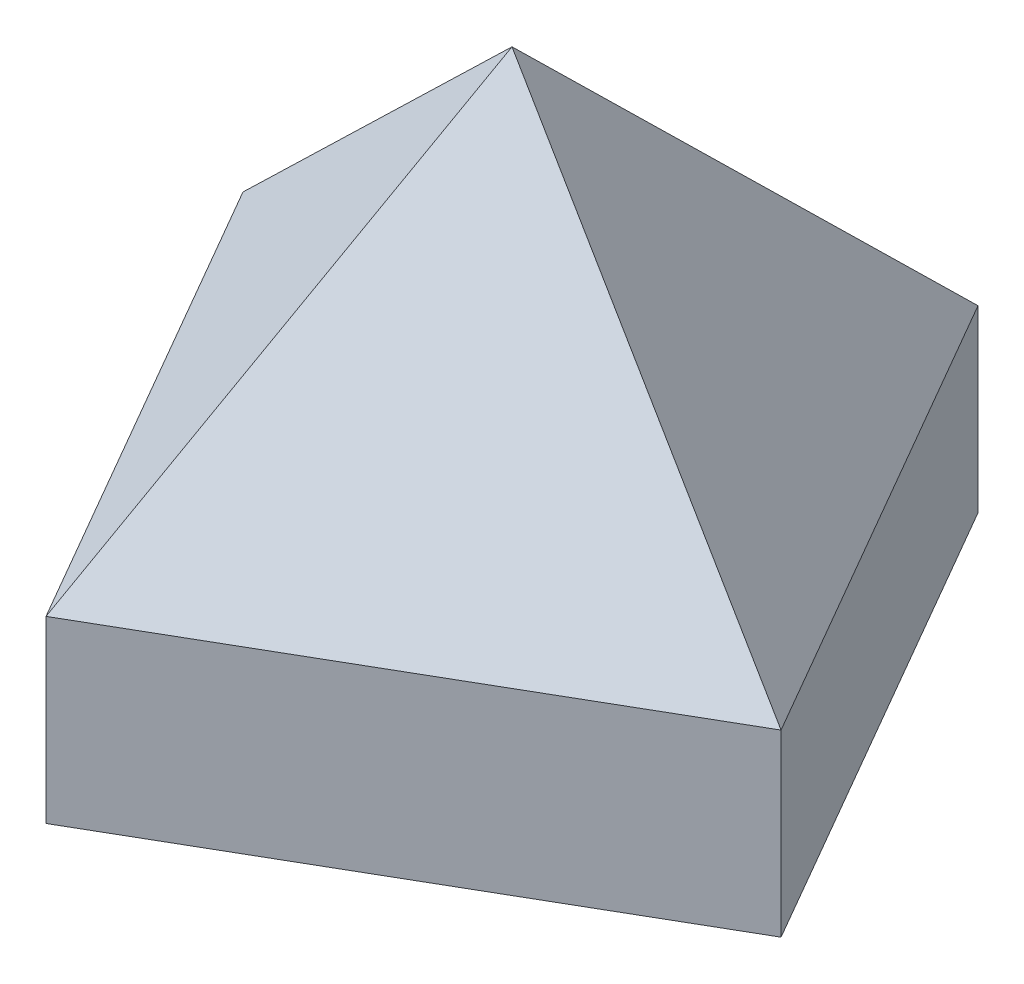
ISO-10303-21;
HEADER;
FILE_DESCRIPTION(('STEP AP214'),'2;1');
FILE_NAME('part.step','',(''),(''),'','','');
FILE_SCHEMA(('AUTOMOTIVE_DESIGN { 1 0 10303 214 1 1 1 1 }'));
ENDSEC;
DATA;
#1=APPLICATION_CONTEXT('core data for automotive mechanical design processes');
#2=APPLICATION_PROTOCOL_DEFINITION('international standard','automotive_design',2000,#1);
#3=PRODUCT_CONTEXT('',#1,'mechanical');
#4=PRODUCT('Part','Part','',(#3));
#5=PRODUCT_RELATED_PRODUCT_CATEGORY('part','',(#4));
#6=PRODUCT_DEFINITION_FORMATION('','',#4);
#7=PRODUCT_DEFINITION_CONTEXT('part definition',#1,'design');
#8=PRODUCT_DEFINITION('design','',#6,#7);
#9=PRODUCT_DEFINITION_SHAPE('','',#8);
#10=(LENGTH_UNIT() NAMED_UNIT(*) SI_UNIT(.MILLI.,.METRE.));
#11=(NAMED_UNIT(*) PLANE_ANGLE_UNIT() SI_UNIT($,.RADIAN.));
#12=(NAMED_UNIT(*) SI_UNIT($,.STERADIAN.) SOLID_ANGLE_UNIT());
#13=UNCERTAINTY_MEASURE_WITH_UNIT(LENGTH_MEASURE(1.E-05),#10,'distance_accuracy_value','');
#14=(GEOMETRIC_REPRESENTATION_CONTEXT(3) GLOBAL_UNCERTAINTY_ASSIGNED_CONTEXT((#13)) GLOBAL_UNIT_ASSIGNED_CONTEXT((#10,
#11,#12)) REPRESENTATION_CONTEXT('',''));
#15=CARTESIAN_POINT('',(0.,0.,0.));
#16=DIRECTION('',(0.,0.,1.));
#17=DIRECTION('',(1.,0.,0.));
#18=AXIS2_PLACEMENT_3D('',#15,#16,#17);
#19=CARTESIAN_POINT('',(-192.912676399366,-4.59542866460026,35.473285749225));
#20=DIRECTION('',(0.692820323027552,-0.6,-0.399999999999998));
#21=DIRECTION('',(0.654653670707977,0.755928946018455,0.));
#22=AXIS2_PLACEMENT_3D('',#19,#20,#21);
#23=PLANE('',#22);
#24=DIRECTION('',(-0.188318516625742,-0.685994340570035,0.702814272053266));
#25=VECTOR('',#24,1.);
#26=CARTESIAN_POINT('',(-115.512563091712,41.1713445614115,100.884054670653));
#27=LINE('',#26,#25);
#28=CARTESIAN_POINT('',(-106.225952641916,75.,66.2259526419165));
#29=VERTEX_POINT('',#28);
#30=CARTESIAN_POINT('',(-119.951905283833,25.,117.451905283833));
#31=VERTEX_POINT('',#30);
#32=EDGE_CURVE('E81',#29,#31,#27,.T.);
#33=ORIENTED_EDGE('',*,*,#32,.F.);
#34=DIRECTION('',(0.702814272053266,0.685994340570035,0.188318516625742));
#35=VECTOR('',#34,1.);
#36=CARTESIAN_POINT('',(-191.489958239234,-8.22344553876478,43.3795311986723));
#37=LINE('',#36,#35);
#38=CARTESIAN_POINT('',(-157.451905283833,25.,52.4999999999998));
#39=VERTEX_POINT('',#38);
#40=EDGE_CURVE('E92',#39,#29,#37,.T.);
#41=ORIENTED_EDGE('',*,*,#40,.F.);
#42=DIRECTION('',(0.499999999999998,0.,0.86602540378444));
#43=VECTOR('',#42,1.);
#44=CARTESIAN_POINT('',(-173.689881604791,25.,24.3749999999999));
#45=LINE('',#44,#43);
#46=EDGE_CURVE('E94',#39,#31,#45,.T.);
#47=ORIENTED_EDGE('',*,*,#46,.T.);
#48=EDGE_LOOP('',(#33,#41,#47));
#49=FACE_BOUND('',#48,.T.);
#50=ADVANCED_FACE('F33',(#49),#23,.F.);
#51=CARTESIAN_POINT('',(-93.2053767364362,1.08599852976445,-22.0927505513382));
#52=DIRECTION('',(-0.692820323027552,-0.6,0.399999999999999));
#53=DIRECTION('',(0.654653670707977,-0.755928946018455,0.));
#54=AXIS2_PLACEMENT_3D('',#51,#52,#53);
#55=PLANE('',#54);
#56=DIRECTION('',(-0.702814272053266,0.685994340570035,-0.188318516625742));
#57=VECTOR('',#56,1.);
#58=CARTESIAN_POINT('',(-75.8477994425475,45.3488645572679,74.3657542592364));
#59=LINE('',#58,#57);
#60=CARTESIAN_POINT('',(-55.,25.,79.9519052838331));
#61=VERTEX_POINT('',#60);
#62=EDGE_CURVE('E78',#61,#29,#59,.T.);
#63=ORIENTED_EDGE('',*,*,#62,.F.);
#64=DIRECTION('',(0.499999999999998,0.,0.86602540378444));
#65=VECTOR('',#64,1.);
#66=CARTESIAN_POINT('',(-108.737976320958,25.,-13.1249999999999));
#67=LINE('',#66,#65);
#68=CARTESIAN_POINT('',(-92.4999999999999,25.,15.));
#69=VERTEX_POINT('',#68);
#70=EDGE_CURVE('E100',#69,#61,#67,.T.);
#71=ORIENTED_EDGE('',*,*,#70,.F.);
#72=DIRECTION('',(0.188318516625742,-0.685994340570035,-0.702814272053266));
#73=VECTOR('',#72,1.);
#74=CARTESIAN_POINT('',(-84.526340031148,-4.04592554290838,-14.7581041260331));
#75=LINE('',#74,#73);
#76=EDGE_CURVE('E11',#29,#69,#75,.T.);
#77=ORIENTED_EDGE('',*,*,#76,.F.);
#78=EDGE_LOOP('',(#63,#71,#77));
#79=FACE_BOUND('',#78,.T.);
#80=ADVANCED_FACE('F102',(#79),#55,.F.);
#81=CARTESIAN_POINT('',(-55.,75.,79.951905283833));
#82=DIRECTION('',(-0.499999999999998,0.,-0.86602540378444));
#83=DIRECTION('',(-0.86602540378444,0.,0.499999999999998));
#84=AXIS2_PLACEMENT_3D('',#81,#82,#83);
#85=PLANE('',#84);
#86=DIRECTION('',(-0.86602540378444,0.,0.499999999999998));
#87=VECTOR('',#86,1.);
#88=CARTESIAN_POINT('',(-26.875,25.,63.713928962875));
#89=LINE('',#88,#87);
#90=EDGE_CURVE('E83',#61,#31,#89,.T.);
#91=ORIENTED_EDGE('',*,*,#90,.T.);
#92=DIRECTION('',(0.,-1.,0.));
#93=VECTOR('',#92,1.);
#94=CARTESIAN_POINT('',(-119.951905283833,75.,117.451905283833));
#95=LINE('',#94,#93);
#96=CARTESIAN_POINT('',(-119.951905283833,0.,117.451905283833));
#97=VERTEX_POINT('',#96);
#98=EDGE_CURVE('E109',#31,#97,#95,.T.);
#99=ORIENTED_EDGE('',*,*,#98,.T.);
#100=DIRECTION('',(0.86602540378444,0.,-0.499999999999998));
#101=VECTOR('',#100,1.);
#102=CARTESIAN_POINT('',(-55.,0.,79.951905283833));
#103=LINE('',#102,#101);
#104=CARTESIAN_POINT('',(-55.,0.,79.951905283833));
#105=VERTEX_POINT('',#104);
#106=EDGE_CURVE('E111',#97,#105,#103,.T.);
#107=ORIENTED_EDGE('',*,*,#106,.T.);
#108=DIRECTION('',(0.,-1.,0.));
#109=VECTOR('',#108,1.);
#110=CARTESIAN_POINT('',(-55.,75.,79.951905283833));
#111=LINE('',#110,#109);
#112=EDGE_CURVE('E55',#61,#105,#111,.T.);
#113=ORIENTED_EDGE('',*,*,#112,.F.);
#114=EDGE_LOOP('',(#91,#99,#107,#113));
#115=FACE_BOUND('',#114,.T.);
#116=ADVANCED_FACE('F129',(#115),#85,.F.);
#117=CARTESIAN_POINT('',(-92.4999999999998,75.,15.));
#118=DIRECTION('',(0.499999999999998,0.,0.86602540378444));
#119=DIRECTION('',(0.86602540378444,0.,-0.499999999999998));
#120=AXIS2_PLACEMENT_3D('',#117,#118,#119);
#121=PLANE('',#120);
#122=DIRECTION('',(-0.86602540378444,0.,0.499999999999998));
#123=VECTOR('',#122,1.);
#124=CARTESIAN_POINT('',(-64.3749999999999,25.,-1.23797632095813));
#125=LINE('',#124,#123);
#126=EDGE_CURVE('E96',#69,#39,#125,.T.);
#127=ORIENTED_EDGE('',*,*,#126,.F.);
#128=DIRECTION('',(0.,-1.,0.));
#129=VECTOR('',#128,1.);
#130=CARTESIAN_POINT('',(-92.4999999999998,75.,15.));
#131=LINE('',#130,#129);
#132=CARTESIAN_POINT('',(-92.4999999999998,0.,15.));
#133=VERTEX_POINT('',#132);
#134=EDGE_CURVE('E48',#69,#133,#131,.T.);
#135=ORIENTED_EDGE('',*,*,#134,.T.);
#136=DIRECTION('',(-0.86602540378444,0.,0.499999999999998));
#137=VECTOR('',#136,1.);
#138=CARTESIAN_POINT('',(-92.4999999999998,0.,15.));
#139=LINE('',#138,#137);
#140=CARTESIAN_POINT('',(-157.451905283833,0.,52.4999999999998));
#141=VERTEX_POINT('',#140);
#142=EDGE_CURVE('E124',#133,#141,#139,.T.);
#143=ORIENTED_EDGE('',*,*,#142,.T.);
#144=DIRECTION('',(0.,-1.,0.));
#145=VECTOR('',#144,1.);
#146=CARTESIAN_POINT('',(-157.451905283833,75.,52.4999999999998));
#147=LINE('',#146,#145);
#148=EDGE_CURVE('E41',#39,#141,#147,.T.);
#149=ORIENTED_EDGE('',*,*,#148,.F.);
#150=EDGE_LOOP('',(#127,#135,#143,#149));
#151=FACE_BOUND('',#150,.T.);
#152=ADVANCED_FACE('F35',(#151),#121,.F.);
#153=CARTESIAN_POINT('',(-157.451905283833,75.,52.4999999999998));
#154=DIRECTION('',(0.86602540378444,0.,-0.499999999999998));
#155=DIRECTION('',(-0.499999999999998,0.,-0.86602540378444));
#156=AXIS2_PLACEMENT_3D('',#153,#154,#155);
#157=PLANE('',#156);
#158=ORIENTED_EDGE('',*,*,#98,.F.);
#159=ORIENTED_EDGE('',*,*,#46,.F.);
#160=ORIENTED_EDGE('',*,*,#148,.T.);
#161=DIRECTION('',(0.499999999999998,0.,0.86602540378444));
#162=VECTOR('',#161,1.);
#163=CARTESIAN_POINT('',(-157.451905283833,0.,52.4999999999998));
#164=LINE('',#163,#162);
#165=EDGE_CURVE('E120',#141,#97,#164,.T.);
#166=ORIENTED_EDGE('',*,*,#165,.T.);
#167=EDGE_LOOP('',(#158,#159,#160,#166));
#168=FACE_BOUND('',#167,.T.);
#169=ADVANCED_FACE('F119',(#168),#157,.F.);
#170=CARTESIAN_POINT('',(-92.4999999999998,75.,15.));
#171=DIRECTION('',(-0.86602540378444,0.,0.499999999999998));
#172=DIRECTION('',(0.499999999999998,0.,0.86602540378444));
#173=AXIS2_PLACEMENT_3D('',#170,#171,#172);
#174=PLANE('',#173);
#175=ORIENTED_EDGE('',*,*,#134,.F.);
#176=ORIENTED_EDGE('',*,*,#70,.T.);
#177=ORIENTED_EDGE('',*,*,#112,.T.);
#178=DIRECTION('',(-0.499999999999998,0.,-0.86602540378444));
#179=VECTOR('',#178,1.);
#180=CARTESIAN_POINT('',(-92.4999999999998,0.,15.));
#181=LINE('',#180,#179);
#182=EDGE_CURVE('E106',#105,#133,#181,.T.);
#183=ORIENTED_EDGE('',*,*,#182,.T.);
#184=EDGE_LOOP('',(#175,#176,#177,#183));
#185=FACE_BOUND('',#184,.T.);
#186=ADVANCED_FACE('F104',(#185),#174,.F.);
#187=CARTESIAN_POINT('',(-157.451905283833,0.,52.4999999999998));
#188=DIRECTION('',(0.,1.,0.));
#189=DIRECTION('',(0.,0.,1.));
#190=AXIS2_PLACEMENT_3D('',#187,#188,#189);
#191=PLANE('',#190);
#192=ORIENTED_EDGE('',*,*,#142,.F.);
#193=ORIENTED_EDGE('',*,*,#182,.F.);
#194=ORIENTED_EDGE('',*,*,#106,.F.);
#195=ORIENTED_EDGE('',*,*,#165,.F.);
#196=EDGE_LOOP('',(#192,#193,#194,#195));
#197=FACE_BOUND('',#196,.T.);
#198=ADVANCED_FACE('F123',(#197),#191,.F.);
#199=CARTESIAN_POINT('',(-75.4732857492249,-4.59542866460027,-20.4607711155336));
#200=DIRECTION('',(-0.399999999999998,0.6,-0.692820323027552));
#201=DIRECTION('',(0.,0.755928946018455,0.654653670707977));
#202=AXIS2_PLACEMENT_3D('',#199,#200,#201);
#203=PLANE('',#202);
#204=ORIENTED_EDGE('',*,*,#40,.T.);
#205=ORIENTED_EDGE('',*,*,#76,.T.);
#206=ORIENTED_EDGE('',*,*,#126,.T.);
#207=EDGE_LOOP('',(#204,#205,#206));
#208=FACE_BOUND('',#207,.T.);
#209=ADVANCED_FACE('F99',(#208),#203,.T.);
#210=CARTESIAN_POINT('',(-17.9072494486617,1.08599852976449,79.2465285473967));
#211=DIRECTION('',(0.399999999999998,0.6,0.692820323027552));
#212=DIRECTION('',(0.,-0.755928946018455,0.654653670707977));
#213=AXIS2_PLACEMENT_3D('',#210,#211,#212);
#214=PLANE('',#213);
#215=ORIENTED_EDGE('',*,*,#32,.T.);
#216=ORIENTED_EDGE('',*,*,#90,.F.);
#217=ORIENTED_EDGE('',*,*,#62,.T.);
#218=EDGE_LOOP('',(#215,#216,#217));
#219=FACE_BOUND('',#218,.T.);
#220=ADVANCED_FACE('F80',(#219),#214,.T.);
#221=CLOSED_SHELL('',(#50,#80,#116,#152,#169,#186,#198,#209,#220));
#222=MANIFOLD_SOLID_BREP('B2',#221);
#223=ADVANCED_BREP_SHAPE_REPRESENTATION('',(#18,#222),#14);
#224=SHAPE_DEFINITION_REPRESENTATION(#9,#223);
ENDSEC;
END-ISO-10303-21;
